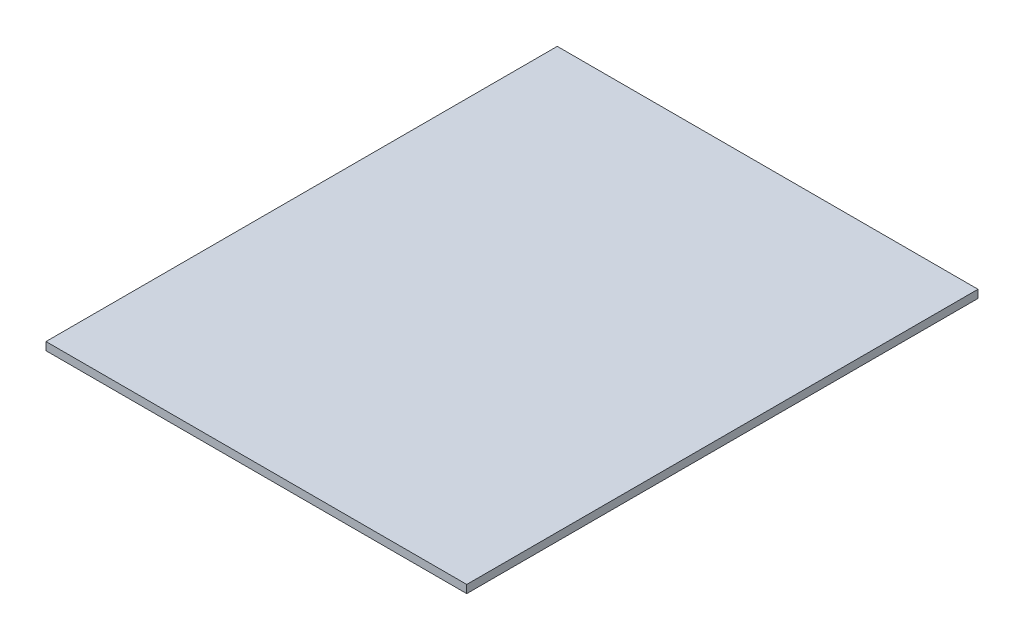
ISO-10303-21;
HEADER;
FILE_DESCRIPTION(('STEP AP214'),'2;1');
FILE_NAME('part.step','',(''),(''),'','','');
FILE_SCHEMA(('AUTOMOTIVE_DESIGN { 1 0 10303 214 1 1 1 1 }'));
ENDSEC;
DATA;
#1=APPLICATION_CONTEXT('core data for automotive mechanical design processes');
#2=APPLICATION_PROTOCOL_DEFINITION('international standard','automotive_design',2000,#1);
#3=PRODUCT_CONTEXT('',#1,'mechanical');
#4=PRODUCT('Part','Part','',(#3));
#5=PRODUCT_RELATED_PRODUCT_CATEGORY('part','',(#4));
#6=PRODUCT_DEFINITION_FORMATION('','',#4);
#7=PRODUCT_DEFINITION_CONTEXT('part definition',#1,'design');
#8=PRODUCT_DEFINITION('design','',#6,#7);
#9=PRODUCT_DEFINITION_SHAPE('','',#8);
#10=(LENGTH_UNIT() NAMED_UNIT(*) SI_UNIT(.MILLI.,.METRE.));
#11=(NAMED_UNIT(*) PLANE_ANGLE_UNIT() SI_UNIT($,.RADIAN.));
#12=(NAMED_UNIT(*) SI_UNIT($,.STERADIAN.) SOLID_ANGLE_UNIT());
#13=UNCERTAINTY_MEASURE_WITH_UNIT(LENGTH_MEASURE(1.E-05),#10,'distance_accuracy_value','');
#14=(GEOMETRIC_REPRESENTATION_CONTEXT(3) GLOBAL_UNCERTAINTY_ASSIGNED_CONTEXT((#13)) GLOBAL_UNIT_ASSIGNED_CONTEXT((#10,
#11,#12)) REPRESENTATION_CONTEXT('',''));
#15=CARTESIAN_POINT('',(0.,0.,0.));
#16=DIRECTION('',(0.,0.,1.));
#17=DIRECTION('',(1.,0.,0.));
#18=AXIS2_PLACEMENT_3D('',#15,#16,#17);
#19=CARTESIAN_POINT('',(0.,4.7625,0.));
#20=DIRECTION('',(1.,0.,0.));
#21=DIRECTION('',(0.,0.,-1.));
#22=AXIS2_PLACEMENT_3D('',#19,#20,#21);
#23=PLANE('',#22);
#24=DIRECTION('',(0.,0.,1.));
#25=VECTOR('',#24,1.);
#26=CARTESIAN_POINT('',(0.,0.,0.));
#27=LINE('',#26,#25);
#28=CARTESIAN_POINT('',(0.,0.,0.));
#29=VERTEX_POINT('',#28);
#30=CARTESIAN_POINT('',(1.29805844787961E-13,0.,304.8));
#31=VERTEX_POINT('',#30);
#32=EDGE_CURVE('E96',#29,#31,#27,.T.);
#33=ORIENTED_EDGE('',*,*,#32,.T.);
#34=DIRECTION('',(0.,-1.,0.));
#35=VECTOR('',#34,1.);
#36=CARTESIAN_POINT('',(1.29805844787961E-13,4.7625,304.8));
#37=LINE('',#36,#35);
#38=CARTESIAN_POINT('',(1.29805844787961E-13,4.7625,304.8));
#39=VERTEX_POINT('',#38);
#40=EDGE_CURVE('E11',#39,#31,#37,.T.);
#41=ORIENTED_EDGE('',*,*,#40,.F.);
#42=DIRECTION('',(0.,0.,1.));
#43=VECTOR('',#42,1.);
#44=CARTESIAN_POINT('',(0.,4.7625,0.));
#45=LINE('',#44,#43);
#46=CARTESIAN_POINT('',(0.,4.7625,0.));
#47=VERTEX_POINT('',#46);
#48=EDGE_CURVE('E82',#47,#39,#45,.T.);
#49=ORIENTED_EDGE('',*,*,#48,.F.);
#50=DIRECTION('',(0.,-1.,0.));
#51=VECTOR('',#50,1.);
#52=CARTESIAN_POINT('',(0.,4.7625,0.));
#53=LINE('',#52,#51);
#54=EDGE_CURVE('E49',#47,#29,#53,.T.);
#55=ORIENTED_EDGE('',*,*,#54,.T.);
#56=EDGE_LOOP('',(#33,#41,#49,#55));
#57=FACE_BOUND('',#56,.T.);
#58=ADVANCED_FACE('F33',(#57),#23,.F.);
#59=CARTESIAN_POINT('',(1.29805844787961E-13,4.7625,304.8));
#60=DIRECTION('',(0.,0.,-1.));
#61=DIRECTION('',(-1.,0.,0.));
#62=AXIS2_PLACEMENT_3D('',#59,#60,#61);
#63=PLANE('',#62);
#64=DIRECTION('',(1.,0.,0.));
#65=VECTOR('',#64,1.);
#66=CARTESIAN_POINT('',(1.29805844787961E-13,0.,304.8));
#67=LINE('',#66,#65);
#68=CARTESIAN_POINT('',(250.825,0.,304.8));
#69=VERTEX_POINT('',#68);
#70=EDGE_CURVE('E87',#31,#69,#67,.T.);
#71=ORIENTED_EDGE('',*,*,#70,.T.);
#72=DIRECTION('',(0.,-1.,0.));
#73=VECTOR('',#72,1.);
#74=CARTESIAN_POINT('',(250.825,4.7625,304.8));
#75=LINE('',#74,#73);
#76=CARTESIAN_POINT('',(250.825,4.7625,304.8));
#77=VERTEX_POINT('',#76);
#78=EDGE_CURVE('E41',#77,#69,#75,.T.);
#79=ORIENTED_EDGE('',*,*,#78,.F.);
#80=DIRECTION('',(1.,0.,0.));
#81=VECTOR('',#80,1.);
#82=CARTESIAN_POINT('',(1.29805844787961E-13,4.7625,304.8));
#83=LINE('',#82,#81);
#84=EDGE_CURVE('E74',#39,#77,#83,.T.);
#85=ORIENTED_EDGE('',*,*,#84,.F.);
#86=ORIENTED_EDGE('',*,*,#40,.T.);
#87=EDGE_LOOP('',(#71,#79,#85,#86));
#88=FACE_BOUND('',#87,.T.);
#89=ADVANCED_FACE('F86',(#88),#63,.F.);
#90=CARTESIAN_POINT('',(250.825,4.7625,0.));
#91=DIRECTION('',(1.,0.,0.));
#92=DIRECTION('',(0.,0.,-1.));
#93=AXIS2_PLACEMENT_3D('',#90,#91,#92);
#94=PLANE('',#93);
#95=DIRECTION('',(0.,0.,1.));
#96=VECTOR('',#95,1.);
#97=CARTESIAN_POINT('',(250.825,0.,0.));
#98=LINE('',#97,#96);
#99=CARTESIAN_POINT('',(250.825,0.,0.));
#100=VERTEX_POINT('',#99);
#101=EDGE_CURVE('E99',#100,#69,#98,.T.);
#102=ORIENTED_EDGE('',*,*,#101,.F.);
#103=DIRECTION('',(0.,-1.,0.));
#104=VECTOR('',#103,1.);
#105=CARTESIAN_POINT('',(250.825,4.7625,0.));
#106=LINE('',#105,#104);
#107=CARTESIAN_POINT('',(250.825,4.7625,0.));
#108=VERTEX_POINT('',#107);
#109=EDGE_CURVE('E63',#108,#100,#106,.T.);
#110=ORIENTED_EDGE('',*,*,#109,.F.);
#111=DIRECTION('',(0.,0.,1.));
#112=VECTOR('',#111,1.);
#113=CARTESIAN_POINT('',(250.825,4.7625,0.));
#114=LINE('',#113,#112);
#115=EDGE_CURVE('E81',#108,#77,#114,.T.);
#116=ORIENTED_EDGE('',*,*,#115,.T.);
#117=ORIENTED_EDGE('',*,*,#78,.T.);
#118=EDGE_LOOP('',(#102,#110,#116,#117));
#119=FACE_BOUND('',#118,.T.);
#120=ADVANCED_FACE('F90',(#119),#94,.T.);
#121=CARTESIAN_POINT('',(0.,4.7625,0.));
#122=DIRECTION('',(0.,0.,-1.));
#123=DIRECTION('',(-1.,0.,0.));
#124=AXIS2_PLACEMENT_3D('',#121,#122,#123);
#125=PLANE('',#124);
#126=DIRECTION('',(1.,0.,0.));
#127=VECTOR('',#126,1.);
#128=CARTESIAN_POINT('',(0.,0.,0.));
#129=LINE('',#128,#127);
#130=EDGE_CURVE('E101',#29,#100,#129,.T.);
#131=ORIENTED_EDGE('',*,*,#130,.F.);
#132=ORIENTED_EDGE('',*,*,#54,.F.);
#133=DIRECTION('',(1.,0.,0.));
#134=VECTOR('',#133,1.);
#135=CARTESIAN_POINT('',(0.,4.7625,0.));
#136=LINE('',#135,#134);
#137=EDGE_CURVE('E91',#47,#108,#136,.T.);
#138=ORIENTED_EDGE('',*,*,#137,.T.);
#139=ORIENTED_EDGE('',*,*,#109,.T.);
#140=EDGE_LOOP('',(#131,#132,#138,#139));
#141=FACE_BOUND('',#140,.T.);
#142=ADVANCED_FACE('F107',(#141),#125,.T.);
#143=CARTESIAN_POINT('',(0.,4.7625,0.));
#144=DIRECTION('',(0.,1.,0.));
#145=DIRECTION('',(0.,0.,1.));
#146=AXIS2_PLACEMENT_3D('',#143,#144,#145);
#147=PLANE('',#146);
#148=ORIENTED_EDGE('',*,*,#48,.T.);
#149=ORIENTED_EDGE('',*,*,#84,.T.);
#150=ORIENTED_EDGE('',*,*,#115,.F.);
#151=ORIENTED_EDGE('',*,*,#137,.F.);
#152=EDGE_LOOP('',(#148,#149,#150,#151));
#153=FACE_BOUND('',#152,.T.);
#154=ADVANCED_FACE('F78',(#153),#147,.T.);
#155=CARTESIAN_POINT('',(0.,0.,0.));
#156=DIRECTION('',(0.,1.,0.));
#157=DIRECTION('',(0.,0.,1.));
#158=AXIS2_PLACEMENT_3D('',#155,#156,#157);
#159=PLANE('',#158);
#160=ORIENTED_EDGE('',*,*,#32,.F.);
#161=ORIENTED_EDGE('',*,*,#130,.T.);
#162=ORIENTED_EDGE('',*,*,#101,.T.);
#163=ORIENTED_EDGE('',*,*,#70,.F.);
#164=EDGE_LOOP('',(#160,#161,#162,#163));
#165=FACE_BOUND('',#164,.T.);
#166=ADVANCED_FACE('F106',(#165),#159,.F.);
#167=CLOSED_SHELL('',(#58,#89,#120,#142,#154,#166));
#168=MANIFOLD_SOLID_BREP('B2',#167);
#169=ADVANCED_BREP_SHAPE_REPRESENTATION('',(#18,#168),#14);
#170=SHAPE_DEFINITION_REPRESENTATION(#9,#169);
ENDSEC;
END-ISO-10303-21;
